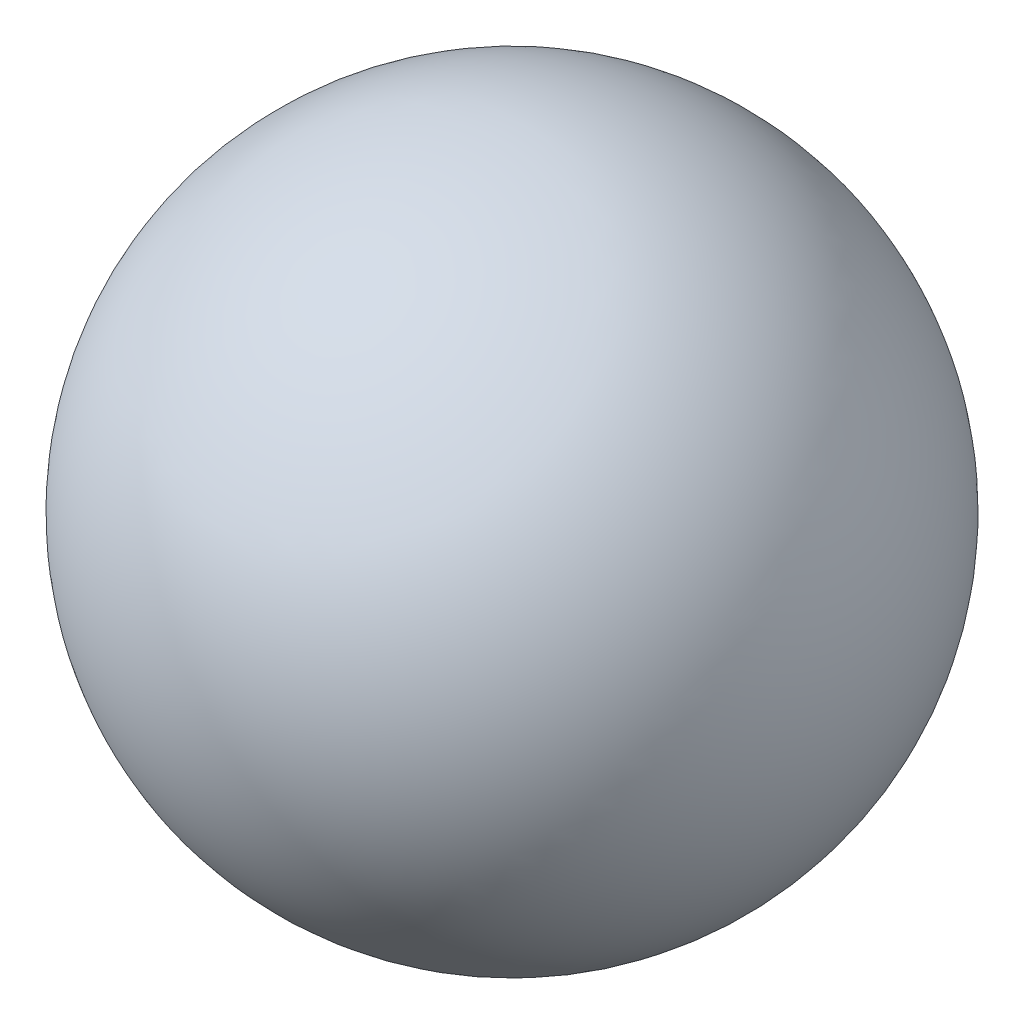
ISO-10303-21;
HEADER;
FILE_DESCRIPTION(('STEP AP214'),'2;1');
FILE_NAME('part.step','',(''),(''),'','','');
FILE_SCHEMA(('AUTOMOTIVE_DESIGN { 1 0 10303 214 1 1 1 1 }'));
ENDSEC;
DATA;
#1=APPLICATION_CONTEXT('core data for automotive mechanical design processes');
#2=APPLICATION_PROTOCOL_DEFINITION('international standard','automotive_design',2000,#1);
#3=PRODUCT_CONTEXT('',#1,'mechanical');
#4=PRODUCT('Part','Part','',(#3));
#5=PRODUCT_RELATED_PRODUCT_CATEGORY('part','',(#4));
#6=PRODUCT_DEFINITION_FORMATION('','',#4);
#7=PRODUCT_DEFINITION_CONTEXT('part definition',#1,'design');
#8=PRODUCT_DEFINITION('design','',#6,#7);
#9=PRODUCT_DEFINITION_SHAPE('','',#8);
#10=(LENGTH_UNIT() NAMED_UNIT(*) SI_UNIT(.MILLI.,.METRE.));
#11=(NAMED_UNIT(*) PLANE_ANGLE_UNIT() SI_UNIT($,.RADIAN.));
#12=(NAMED_UNIT(*) SI_UNIT($,.STERADIAN.) SOLID_ANGLE_UNIT());
#13=UNCERTAINTY_MEASURE_WITH_UNIT(LENGTH_MEASURE(1.E-05),#10,'distance_accuracy_value','');
#14=(GEOMETRIC_REPRESENTATION_CONTEXT(3) GLOBAL_UNCERTAINTY_ASSIGNED_CONTEXT((#13)) GLOBAL_UNIT_ASSIGNED_CONTEXT((#10,
#11,#12)) REPRESENTATION_CONTEXT('',''));
#15=CARTESIAN_POINT('',(0.,0.,0.));
#16=DIRECTION('',(0.,0.,1.));
#17=DIRECTION('',(1.,0.,0.));
#18=AXIS2_PLACEMENT_3D('',#15,#16,#17);
#19=CARTESIAN_POINT('',(11.4187859278016,-2.,2.77016749223579));
#20=DIRECTION('',(0.,0.,1.));
#21=DIRECTION('',(1.,0.,0.));
#22=AXIS2_PLACEMENT_3D('',#19,#20,#21);
#23=SPHERICAL_SURFACE('',#22,1.05);
#24=CARTESIAN_POINT('',(11.4187859278016,-2.,3.82016749223579));
#25=VERTEX_POINT('',#24);
#26=VERTEX_LOOP('',#25);
#27=FACE_BOUND('',#26,.T.);
#28=ADVANCED_FACE('F13',(#27),#23,.T.);
#29=CLOSED_SHELL('',(#28));
#30=MANIFOLD_SOLID_BREP('B1',#29);
#31=ADVANCED_BREP_SHAPE_REPRESENTATION('',(#18,#30),#14);
#32=SHAPE_DEFINITION_REPRESENTATION(#9,#31);
ENDSEC;
END-ISO-10303-21;
